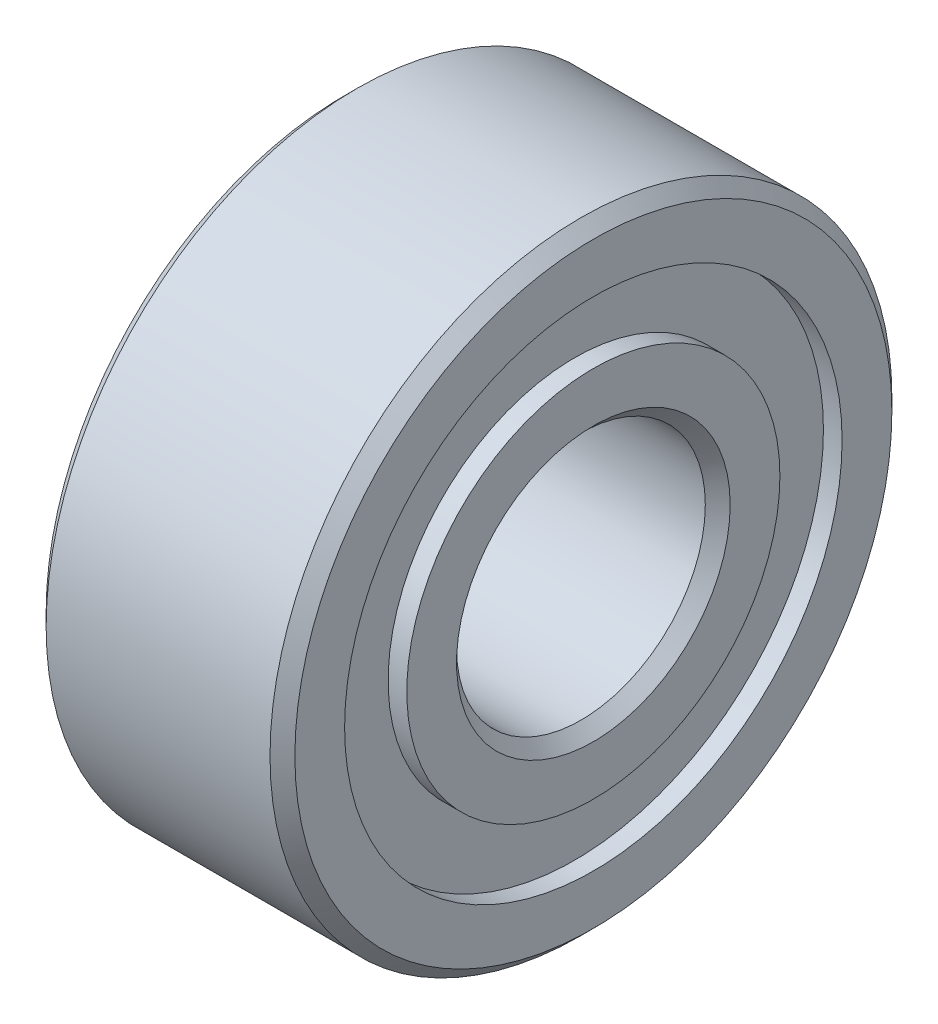
ISO-10303-21;
HEADER;
FILE_DESCRIPTION(('STEP AP214'),'2;1');
FILE_NAME('part.step','',(''),(''),'','','');
FILE_SCHEMA(('AUTOMOTIVE_DESIGN { 1 0 10303 214 1 1 1 1 }'));
ENDSEC;
DATA;
#1=APPLICATION_CONTEXT('core data for automotive mechanical design processes');
#2=APPLICATION_PROTOCOL_DEFINITION('international standard','automotive_design',2000,#1);
#3=PRODUCT_CONTEXT('',#1,'mechanical');
#4=PRODUCT('Part','Part','',(#3));
#5=PRODUCT_RELATED_PRODUCT_CATEGORY('part','',(#4));
#6=PRODUCT_DEFINITION_FORMATION('','',#4);
#7=PRODUCT_DEFINITION_CONTEXT('part definition',#1,'design');
#8=PRODUCT_DEFINITION('design','',#6,#7);
#9=PRODUCT_DEFINITION_SHAPE('','',#8);
#10=(LENGTH_UNIT() NAMED_UNIT(*) SI_UNIT(.MILLI.,.METRE.));
#11=(NAMED_UNIT(*) PLANE_ANGLE_UNIT() SI_UNIT($,.RADIAN.));
#12=(NAMED_UNIT(*) SI_UNIT($,.STERADIAN.) SOLID_ANGLE_UNIT());
#13=UNCERTAINTY_MEASURE_WITH_UNIT(LENGTH_MEASURE(1.E-05),#10,'distance_accuracy_value','');
#14=(GEOMETRIC_REPRESENTATION_CONTEXT(3) GLOBAL_UNCERTAINTY_ASSIGNED_CONTEXT((#13)) GLOBAL_UNIT_ASSIGNED_CONTEXT((#10,
#11,#12)) REPRESENTATION_CONTEXT('',''));
#15=CARTESIAN_POINT('',(0.,0.,0.));
#16=DIRECTION('',(0.,0.,1.));
#17=DIRECTION('',(1.,0.,0.));
#18=AXIS2_PLACEMENT_3D('',#15,#16,#17);
#19=CARTESIAN_POINT('',(0.,0.,0.));
#20=DIRECTION('',(1.,0.,0.));
#21=DIRECTION('',(0.,0.,-1.));
#22=AXIS2_PLACEMENT_3D('',#19,#20,#21);
#23=PLANE('',#22);
#24=CARTESIAN_POINT('',(0.,0.,0.));
#25=DIRECTION('',(1.,0.,0.));
#26=DIRECTION('',(0.,0.,-1.));
#27=AXIS2_PLACEMENT_3D('',#24,#25,#26);
#28=CIRCLE('',#27,2.2);
#29=CARTESIAN_POINT('',(0.,0.,-2.2));
#30=VERTEX_POINT('',#29);
#31=EDGE_CURVE('E55',#30,#30,#28,.T.);
#32=ORIENTED_EDGE('',*,*,#31,.T.);
#33=EDGE_LOOP('',(#32));
#34=FACE_BOUND('',#33,.T.);
#35=CARTESIAN_POINT('',(0.,0.,0.));
#36=DIRECTION('',(-1.,0.,0.));
#37=DIRECTION('',(0.,0.,1.));
#38=AXIS2_PLACEMENT_3D('',#35,#36,#37);
#39=CIRCLE('',#38,3.);
#40=CARTESIAN_POINT('',(0.,0.,3.));
#41=VERTEX_POINT('',#40);
#42=EDGE_CURVE('E86',#41,#41,#39,.T.);
#43=ORIENTED_EDGE('',*,*,#42,.T.);
#44=EDGE_LOOP('',(#43));
#45=FACE_BOUND('',#44,.T.);
#46=ADVANCED_FACE('F35',(#34,#45),#23,.F.);
#47=CARTESIAN_POINT('',(4.,0.,0.));
#48=DIRECTION('',(1.,0.,0.));
#49=DIRECTION('',(0.,0.,-1.));
#50=AXIS2_PLACEMENT_3D('',#47,#48,#49);
#51=PLANE('',#50);
#52=CARTESIAN_POINT('',(4.,0.,0.));
#53=DIRECTION('',(1.,0.,0.));
#54=DIRECTION('',(0.,0.,-1.));
#55=AXIS2_PLACEMENT_3D('',#52,#53,#54);
#56=CIRCLE('',#55,2.2);
#57=CARTESIAN_POINT('',(4.,0.,-2.2));
#58=VERTEX_POINT('',#57);
#59=EDGE_CURVE('E10',#58,#58,#56,.F.);
#60=ORIENTED_EDGE('',*,*,#59,.T.);
#61=EDGE_LOOP('',(#60));
#62=FACE_BOUND('',#61,.T.);
#63=CARTESIAN_POINT('',(4.,0.,0.000375624504543939));
#64=DIRECTION('',(1.,0.,0.));
#65=DIRECTION('',(0.,0.,-1.));
#66=AXIS2_PLACEMENT_3D('',#63,#64,#65);
#67=CIRCLE('',#66,3.);
#68=CARTESIAN_POINT('',(4.,0.,-2.99962437549546));
#69=VERTEX_POINT('',#68);
#70=EDGE_CURVE('E74',#69,#69,#67,.T.);
#71=ORIENTED_EDGE('',*,*,#70,.T.);
#72=EDGE_LOOP('',(#71));
#73=FACE_BOUND('',#72,.T.);
#74=ADVANCED_FACE('F134',(#62,#73),#51,.T.);
#75=CARTESIAN_POINT('',(4.,0.,0.));
#76=DIRECTION('',(1.,0.,0.));
#77=DIRECTION('',(0.,0.,-1.));
#78=AXIS2_PLACEMENT_3D('',#75,#76,#77);
#79=CIRCLE('',#78,4.8);
#80=CARTESIAN_POINT('',(4.,0.,-4.8));
#81=VERTEX_POINT('',#80);
#82=EDGE_CURVE('E64',#81,#81,#79,.T.);
#83=ORIENTED_EDGE('',*,*,#82,.T.);
#84=EDGE_LOOP('',(#83));
#85=FACE_BOUND('',#84,.T.);
#86=CARTESIAN_POINT('',(4.,0.,0.000375624504543939));
#87=DIRECTION('',(1.,0.,0.));
#88=DIRECTION('',(0.,0.,-1.));
#89=AXIS2_PLACEMENT_3D('',#86,#87,#88);
#90=CIRCLE('',#89,4.);
#91=CARTESIAN_POINT('',(4.,0.,-3.99962437549546));
#92=VERTEX_POINT('',#91);
#93=EDGE_CURVE('E68',#92,#92,#90,.T.);
#94=ORIENTED_EDGE('',*,*,#93,.F.);
#95=EDGE_LOOP('',(#94));
#96=FACE_BOUND('',#95,.T.);
#97=ADVANCED_FACE('F111',(#85,#96),#51,.T.);
#98=CARTESIAN_POINT('',(0.,0.,0.));
#99=DIRECTION('',(-1.,0.,0.));
#100=DIRECTION('',(0.,0.,1.));
#101=AXIS2_PLACEMENT_3D('',#98,#99,#100);
#102=CIRCLE('',#101,4.);
#103=CARTESIAN_POINT('',(0.,0.,4.));
#104=VERTEX_POINT('',#103);
#105=EDGE_CURVE('E80',#104,#104,#102,.T.);
#106=ORIENTED_EDGE('',*,*,#105,.F.);
#107=EDGE_LOOP('',(#106));
#108=FACE_BOUND('',#107,.T.);
#109=CARTESIAN_POINT('',(0.,0.,0.));
#110=DIRECTION('',(1.,0.,0.));
#111=DIRECTION('',(0.,0.,-1.));
#112=AXIS2_PLACEMENT_3D('',#109,#110,#111);
#113=CIRCLE('',#112,4.8);
#114=CARTESIAN_POINT('',(0.,0.,-4.8));
#115=VERTEX_POINT('',#114);
#116=EDGE_CURVE('E50',#115,#115,#113,.F.);
#117=ORIENTED_EDGE('',*,*,#116,.T.);
#118=EDGE_LOOP('',(#117));
#119=FACE_BOUND('',#118,.T.);
#120=ADVANCED_FACE('F107',(#108,#119),#23,.F.);
#121=CARTESIAN_POINT('',(4.,0.,0.));
#122=DIRECTION('',(-1.,0.,0.));
#123=DIRECTION('',(0.,0.,1.));
#124=AXIS2_PLACEMENT_3D('',#121,#122,#123);
#125=CYLINDRICAL_SURFACE('',#124,5.);
#126=CARTESIAN_POINT('',(3.8,0.,0.));
#127=DIRECTION('',(1.,0.,0.));
#128=DIRECTION('',(0.,0.,-1.));
#129=AXIS2_PLACEMENT_3D('',#126,#127,#128);
#130=CIRCLE('',#129,5.);
#131=CARTESIAN_POINT('',(3.8,0.,-5.));
#132=VERTEX_POINT('',#131);
#133=EDGE_CURVE('E58',#132,#132,#130,.F.);
#134=ORIENTED_EDGE('',*,*,#133,.T.);
#135=EDGE_LOOP('',(#134));
#136=FACE_BOUND('',#135,.T.);
#137=CARTESIAN_POINT('',(0.200000000000001,0.,0.));
#138=DIRECTION('',(1.,0.,0.));
#139=DIRECTION('',(0.,0.,-1.));
#140=AXIS2_PLACEMENT_3D('',#137,#138,#139);
#141=CIRCLE('',#140,5.);
#142=CARTESIAN_POINT('',(0.200000000000001,0.,-5.));
#143=VERTEX_POINT('',#142);
#144=EDGE_CURVE('E61',#143,#143,#141,.T.);
#145=ORIENTED_EDGE('',*,*,#144,.T.);
#146=EDGE_LOOP('',(#145));
#147=FACE_BOUND('',#146,.T.);
#148=ADVANCED_FACE('F110',(#136,#147),#125,.T.);
#149=CARTESIAN_POINT('',(4.,0.,0.));
#150=DIRECTION('',(-1.,0.,0.));
#151=DIRECTION('',(0.,0.,1.));
#152=AXIS2_PLACEMENT_3D('',#149,#150,#151);
#153=CYLINDRICAL_SURFACE('',#152,2.);
#154=CARTESIAN_POINT('',(3.8,0.,0.));
#155=DIRECTION('',(1.,0.,0.));
#156=DIRECTION('',(0.,0.,-1.));
#157=AXIS2_PLACEMENT_3D('',#154,#155,#156);
#158=CIRCLE('',#157,2.);
#159=CARTESIAN_POINT('',(3.8,0.,-2.));
#160=VERTEX_POINT('',#159);
#161=EDGE_CURVE('E42',#160,#160,#158,.T.);
#162=ORIENTED_EDGE('',*,*,#161,.T.);
#163=EDGE_LOOP('',(#162));
#164=FACE_BOUND('',#163,.T.);
#165=CARTESIAN_POINT('',(0.200000000000002,0.,0.));
#166=DIRECTION('',(1.,0.,0.));
#167=DIRECTION('',(0.,0.,-1.));
#168=AXIS2_PLACEMENT_3D('',#165,#166,#167);
#169=CIRCLE('',#168,2.);
#170=CARTESIAN_POINT('',(0.200000000000002,0.,-2.));
#171=VERTEX_POINT('',#170);
#172=EDGE_CURVE('E46',#171,#171,#169,.F.);
#173=ORIENTED_EDGE('',*,*,#172,.T.);
#174=EDGE_LOOP('',(#173));
#175=FACE_BOUND('',#174,.T.);
#176=ADVANCED_FACE('F124',(#164,#175),#153,.F.);
#177=CARTESIAN_POINT('',(3.7,0.,0.000375624504543939));
#178=DIRECTION('',(1.,0.,0.));
#179=DIRECTION('',(0.,0.,-1.));
#180=AXIS2_PLACEMENT_3D('',#177,#178,#179);
#181=CYLINDRICAL_SURFACE('',#180,4.);
#182=CARTESIAN_POINT('',(3.7,0.,0.000375624504543939));
#183=DIRECTION('',(1.,0.,0.));
#184=DIRECTION('',(0.,0.,-1.));
#185=AXIS2_PLACEMENT_3D('',#182,#183,#184);
#186=CIRCLE('',#185,4.);
#187=CARTESIAN_POINT('',(3.7,0.,-3.99962437549546));
#188=VERTEX_POINT('',#187);
#189=EDGE_CURVE('E67',#188,#188,#186,.T.);
#190=ORIENTED_EDGE('',*,*,#189,.F.);
#191=EDGE_LOOP('',(#190));
#192=FACE_BOUND('',#191,.T.);
#193=ORIENTED_EDGE('',*,*,#93,.T.);
#194=EDGE_LOOP('',(#193));
#195=FACE_BOUND('',#194,.T.);
#196=ADVANCED_FACE('F130',(#192,#195),#181,.F.);
#197=CARTESIAN_POINT('',(3.7,0.,0.000375624504543939));
#198=DIRECTION('',(1.,0.,0.));
#199=DIRECTION('',(0.,0.,-1.));
#200=AXIS2_PLACEMENT_3D('',#197,#198,#199);
#201=PLANE('',#200);
#202=CARTESIAN_POINT('',(3.7,0.,0.000375624504543939));
#203=DIRECTION('',(1.,0.,0.));
#204=DIRECTION('',(0.,0.,-1.));
#205=AXIS2_PLACEMENT_3D('',#202,#203,#204);
#206=CIRCLE('',#205,3.);
#207=CARTESIAN_POINT('',(3.7,0.,-2.99962437549546));
#208=VERTEX_POINT('',#207);
#209=EDGE_CURVE('E71',#208,#208,#206,.T.);
#210=ORIENTED_EDGE('',*,*,#209,.F.);
#211=EDGE_LOOP('',(#210));
#212=FACE_BOUND('',#211,.T.);
#213=ORIENTED_EDGE('',*,*,#189,.T.);
#214=EDGE_LOOP('',(#213));
#215=FACE_BOUND('',#214,.T.);
#216=ADVANCED_FACE('F146',(#212,#215),#201,.T.);
#217=CARTESIAN_POINT('',(3.7,0.,0.000375624504543939));
#218=DIRECTION('',(1.,0.,0.));
#219=DIRECTION('',(0.,0.,-1.));
#220=AXIS2_PLACEMENT_3D('',#217,#218,#219);
#221=CYLINDRICAL_SURFACE('',#220,3.);
#222=ORIENTED_EDGE('',*,*,#209,.T.);
#223=EDGE_LOOP('',(#222));
#224=FACE_BOUND('',#223,.T.);
#225=ORIENTED_EDGE('',*,*,#70,.F.);
#226=EDGE_LOOP('',(#225));
#227=FACE_BOUND('',#226,.T.);
#228=ADVANCED_FACE('F150',(#224,#227),#221,.T.);
#229=CARTESIAN_POINT('',(4.,0.,0.));
#230=DIRECTION('',(-1.,0.,0.));
#231=DIRECTION('',(0.,0.,1.));
#232=AXIS2_PLACEMENT_3D('',#229,#230,#231);
#233=CONICAL_SURFACE('',#232,4.8,0.785398163397442);
#234=ORIENTED_EDGE('',*,*,#133,.F.);
#235=EDGE_LOOP('',(#234));
#236=FACE_BOUND('',#235,.T.);
#237=ORIENTED_EDGE('',*,*,#82,.F.);
#238=EDGE_LOOP('',(#237));
#239=FACE_BOUND('',#238,.T.);
#240=ADVANCED_FACE('F119',(#236,#239),#233,.T.);
#241=CARTESIAN_POINT('',(0.200000000000001,0.,0.));
#242=DIRECTION('',(1.,0.,0.));
#243=DIRECTION('',(0.,0.,-1.));
#244=AXIS2_PLACEMENT_3D('',#241,#242,#243);
#245=CONICAL_SURFACE('',#244,5.,0.785398163397448);
#246=ORIENTED_EDGE('',*,*,#116,.F.);
#247=EDGE_LOOP('',(#246));
#248=FACE_BOUND('',#247,.T.);
#249=ORIENTED_EDGE('',*,*,#144,.F.);
#250=EDGE_LOOP('',(#249));
#251=FACE_BOUND('',#250,.T.);
#252=ADVANCED_FACE('F115',(#248,#251),#245,.T.);
#253=CARTESIAN_POINT('',(3.8,0.,0.));
#254=DIRECTION('',(1.,0.,0.));
#255=DIRECTION('',(0.,0.,-1.));
#256=AXIS2_PLACEMENT_3D('',#253,#254,#255);
#257=CONICAL_SURFACE('',#256,2.,0.785398163397451);
#258=ORIENTED_EDGE('',*,*,#59,.F.);
#259=EDGE_LOOP('',(#258));
#260=FACE_BOUND('',#259,.T.);
#261=ORIENTED_EDGE('',*,*,#161,.F.);
#262=EDGE_LOOP('',(#261));
#263=FACE_BOUND('',#262,.T.);
#264=ADVANCED_FACE('F118',(#260,#263),#257,.F.);
#265=CARTESIAN_POINT('',(0.,0.,0.));
#266=DIRECTION('',(-1.,0.,0.));
#267=DIRECTION('',(0.,0.,1.));
#268=AXIS2_PLACEMENT_3D('',#265,#266,#267);
#269=CONICAL_SURFACE('',#268,2.2,0.785398163397444);
#270=ORIENTED_EDGE('',*,*,#172,.F.);
#271=EDGE_LOOP('',(#270));
#272=FACE_BOUND('',#271,.T.);
#273=ORIENTED_EDGE('',*,*,#31,.F.);
#274=EDGE_LOOP('',(#273));
#275=FACE_BOUND('',#274,.T.);
#276=ADVANCED_FACE('F37',(#272,#275),#269,.F.);
#277=CARTESIAN_POINT('',(0.3,0.,0.));
#278=DIRECTION('',(-1.,0.,0.));
#279=DIRECTION('',(0.,0.,1.));
#280=AXIS2_PLACEMENT_3D('',#277,#278,#279);
#281=CYLINDRICAL_SURFACE('',#280,4.);
#282=CARTESIAN_POINT('',(0.3,0.,0.));
#283=DIRECTION('',(-1.,0.,0.));
#284=DIRECTION('',(0.,0.,1.));
#285=AXIS2_PLACEMENT_3D('',#282,#283,#284);
#286=CIRCLE('',#285,4.);
#287=CARTESIAN_POINT('',(0.3,0.,4.));
#288=VERTEX_POINT('',#287);
#289=EDGE_CURVE('E77',#288,#288,#286,.T.);
#290=ORIENTED_EDGE('',*,*,#289,.F.);
#291=EDGE_LOOP('',(#290));
#292=FACE_BOUND('',#291,.T.);
#293=ORIENTED_EDGE('',*,*,#105,.T.);
#294=EDGE_LOOP('',(#293));
#295=FACE_BOUND('',#294,.T.);
#296=ADVANCED_FACE('F98',(#292,#295),#281,.F.);
#297=CARTESIAN_POINT('',(0.3,0.,0.));
#298=DIRECTION('',(-1.,0.,0.));
#299=DIRECTION('',(0.,0.,1.));
#300=AXIS2_PLACEMENT_3D('',#297,#298,#299);
#301=PLANE('',#300);
#302=CARTESIAN_POINT('',(0.3,0.,0.));
#303=DIRECTION('',(-1.,0.,0.));
#304=DIRECTION('',(0.,0.,1.));
#305=AXIS2_PLACEMENT_3D('',#302,#303,#304);
#306=CIRCLE('',#305,3.);
#307=CARTESIAN_POINT('',(0.3,0.,3.));
#308=VERTEX_POINT('',#307);
#309=EDGE_CURVE('E83',#308,#308,#306,.T.);
#310=ORIENTED_EDGE('',*,*,#309,.F.);
#311=EDGE_LOOP('',(#310));
#312=FACE_BOUND('',#311,.T.);
#313=ORIENTED_EDGE('',*,*,#289,.T.);
#314=EDGE_LOOP('',(#313));
#315=FACE_BOUND('',#314,.T.);
#316=ADVANCED_FACE('F95',(#312,#315),#301,.T.);
#317=CARTESIAN_POINT('',(0.3,0.,0.));
#318=DIRECTION('',(-1.,0.,0.));
#319=DIRECTION('',(0.,0.,1.));
#320=AXIS2_PLACEMENT_3D('',#317,#318,#319);
#321=CYLINDRICAL_SURFACE('',#320,3.);
#322=ORIENTED_EDGE('',*,*,#309,.T.);
#323=EDGE_LOOP('',(#322));
#324=FACE_BOUND('',#323,.T.);
#325=ORIENTED_EDGE('',*,*,#42,.F.);
#326=EDGE_LOOP('',(#325));
#327=FACE_BOUND('',#326,.T.);
#328=ADVANCED_FACE('F92',(#324,#327),#321,.T.);
#329=CLOSED_SHELL('',(#46,#74,#97,#120,#148,#176,#196,#216,#228,#240,#252,#264,#276,#296,#316,#328));
#330=MANIFOLD_SOLID_BREP('B2',#329);
#331=ADVANCED_BREP_SHAPE_REPRESENTATION('',(#18,#330),#14);
#332=SHAPE_DEFINITION_REPRESENTATION(#9,#331);
ENDSEC;
END-ISO-10303-21;
